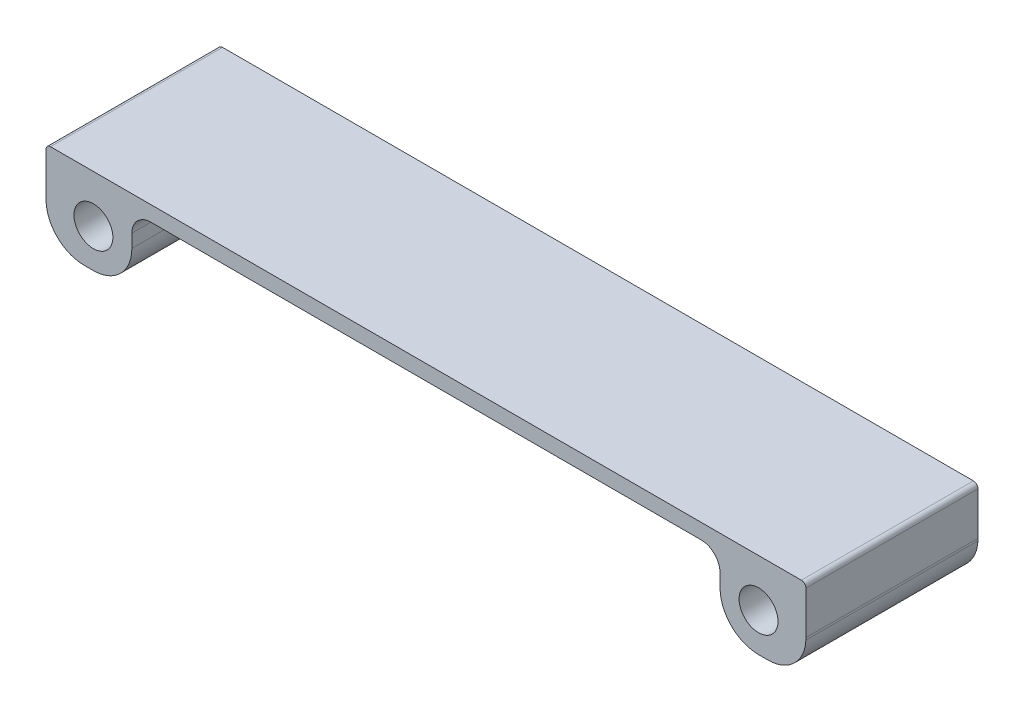
ISO-10303-21;
HEADER;
FILE_DESCRIPTION(('STEP AP214'),'2;1');
FILE_NAME('part.step','',(''),(''),'','','');
FILE_SCHEMA(('AUTOMOTIVE_DESIGN { 1 0 10303 214 1 1 1 1 }'));
ENDSEC;
DATA;
#1=APPLICATION_CONTEXT('core data for automotive mechanical design processes');
#2=APPLICATION_PROTOCOL_DEFINITION('international standard','automotive_design',2000,#1);
#3=PRODUCT_CONTEXT('',#1,'mechanical');
#4=PRODUCT('Part','Part','',(#3));
#5=PRODUCT_RELATED_PRODUCT_CATEGORY('part','',(#4));
#6=PRODUCT_DEFINITION_FORMATION('','',#4);
#7=PRODUCT_DEFINITION_CONTEXT('part definition',#1,'design');
#8=PRODUCT_DEFINITION('design','',#6,#7);
#9=PRODUCT_DEFINITION_SHAPE('','',#8);
#10=(LENGTH_UNIT() NAMED_UNIT(*) SI_UNIT(.MILLI.,.METRE.));
#11=(NAMED_UNIT(*) PLANE_ANGLE_UNIT() SI_UNIT($,.RADIAN.));
#12=(NAMED_UNIT(*) SI_UNIT($,.STERADIAN.) SOLID_ANGLE_UNIT());
#13=UNCERTAINTY_MEASURE_WITH_UNIT(LENGTH_MEASURE(1.E-05),#10,'distance_accuracy_value','');
#14=(GEOMETRIC_REPRESENTATION_CONTEXT(3) GLOBAL_UNCERTAINTY_ASSIGNED_CONTEXT((#13)) GLOBAL_UNIT_ASSIGNED_CONTEXT((#10,
#11,#12)) REPRESENTATION_CONTEXT('',''));
#15=CARTESIAN_POINT('',(0.,0.,0.));
#16=DIRECTION('',(0.,0.,1.));
#17=DIRECTION('',(1.,0.,0.));
#18=AXIS2_PLACEMENT_3D('',#15,#16,#17);
#19=CARTESIAN_POINT('',(0.,-6.42619999985807,0.));
#20=DIRECTION('',(0.,1.,0.));
#21=DIRECTION('',(0.,0.,1.));
#22=AXIS2_PLACEMENT_3D('',#19,#20,#21);
#23=PLANE('',#22);
#24=DIRECTION('',(0.,0.,-1.));
#25=VECTOR('',#24,1.);
#26=CARTESIAN_POINT('',(-1.572955371228,-6.4262,14.3763999995843));
#27=LINE('',#26,#25);
#28=CARTESIAN_POINT('',(-1.572955371228,-6.42619999992903,28.7528));
#29=VERTEX_POINT('',#28);
#30=CARTESIAN_POINT('',(-1.572955371228,-6.42619999996452,-4.15745562976078E-10));
#31=VERTEX_POINT('',#30);
#32=EDGE_CURVE('E157',#29,#31,#27,.T.);
#33=ORIENTED_EDGE('',*,*,#32,.T.);
#34=DIRECTION('',(1.,0.,0.));
#35=VECTOR('',#34,1.);
#36=CARTESIAN_POINT('',(0.,-6.42619999985807,0.));
#37=LINE('',#36,#35);
#38=CARTESIAN_POINT('',(-4.41073369258682E-10,-6.42619999992903,0.));
#39=VERTEX_POINT('',#38);
#40=EDGE_CURVE('E278',#39,#31,#37,.F.);
#41=ORIENTED_EDGE('',*,*,#40,.F.);
#42=DIRECTION('',(0.,0.,1.));
#43=VECTOR('',#42,1.);
#44=CARTESIAN_POINT('',(-8.82146738517363E-10,-6.4262,14.3763999995843));
#45=LINE('',#44,#43);
#46=CARTESIAN_POINT('',(-4.41073369258682E-10,-6.42619999992903,28.7528));
#47=VERTEX_POINT('',#46);
#48=EDGE_CURVE('E259',#39,#47,#45,.T.);
#49=ORIENTED_EDGE('',*,*,#48,.T.);
#50=DIRECTION('',(1.,0.,0.));
#51=VECTOR('',#50,1.);
#52=CARTESIAN_POINT('',(0.,-6.42619999985807,28.7528));
#53=LINE('',#52,#51);
#54=EDGE_CURVE('E149',#29,#47,#53,.T.);
#55=ORIENTED_EDGE('',*,*,#54,.F.);
#56=EDGE_LOOP('',(#33,#41,#49,#55));
#57=FACE_BOUND('',#56,.T.);
#58=ADVANCED_FACE('F17',(#57),#23,.F.);
#59=CARTESIAN_POINT('',(0.,0.,28.7528));
#60=DIRECTION('',(0.,0.,-1.));
#61=DIRECTION('',(0.,1.,0.));
#62=AXIS2_PLACEMENT_3D('',#59,#60,#61);
#63=CYLINDRICAL_SURFACE('',#62,7.92479999937038);
#64=DIRECTION('',(0.,0.,1.));
#65=VECTOR('',#64,1.);
#66=CARTESIAN_POINT('',(-7.91551735214925,-0.383458064454545,14.3763999995843));
#67=LINE('',#66,#65);
#68=CARTESIAN_POINT('',(-7.91551735185295,-0.383458064474924,-8.31491993313893E-10));
#69=VERTEX_POINT('',#68);
#70=CARTESIAN_POINT('',(-7.91551735185295,-0.383458064474936,28.7528));
#71=VERTEX_POINT('',#70);
#72=EDGE_CURVE('E151',#69,#71,#67,.T.);
#73=ORIENTED_EDGE('',*,*,#72,.T.);
#74=CARTESIAN_POINT('',(0.,0.,28.7528));
#75=DIRECTION('',(0.,0.,-1.));
#76=DIRECTION('',(0.,1.,0.));
#77=AXIS2_PLACEMENT_3D('',#74,#75,#76);
#78=CIRCLE('',#77,7.92479999937038);
#79=CARTESIAN_POINT('',(-7.92480000050323,0.,28.7527999988129));
#80=VERTEX_POINT('',#79);
#81=EDGE_CURVE('E20',#80,#71,#78,.F.);
#82=ORIENTED_EDGE('',*,*,#81,.F.);
#83=DIRECTION('',(0.,0.,-1.));
#84=VECTOR('',#83,1.);
#85=CARTESIAN_POINT('',(-7.9248000020129,0.,0.));
#86=LINE('',#85,#84);
#87=CARTESIAN_POINT('',(-7.92480000100645,0.,-8.31491209890388E-10));
#88=VERTEX_POINT('',#87);
#89=EDGE_CURVE('E223',#80,#88,#86,.T.);
#90=ORIENTED_EDGE('',*,*,#89,.T.);
#91=CARTESIAN_POINT('',(0.,0.,-8.31491125952155E-10));
#92=DIRECTION('',(0.,0.,-1.));
#93=DIRECTION('',(0.,1.,0.));
#94=AXIS2_PLACEMENT_3D('',#91,#92,#93);
#95=CIRCLE('',#94,7.92479999937038);
#96=EDGE_CURVE('E148',#69,#88,#95,.T.);
#97=ORIENTED_EDGE('',*,*,#96,.F.);
#98=EDGE_LOOP('',(#73,#82,#90,#97));
#99=FACE_BOUND('',#98,.T.);
#100=ADVANCED_FACE('F152',(#99),#63,.T.);
#101=CARTESIAN_POINT('',(-7.1628,7.1628,28.7528));
#102=DIRECTION('',(0.,0.,-1.));
#103=DIRECTION('',(0.,1.,0.));
#104=AXIS2_PLACEMENT_3D('',#101,#102,#103);
#105=CYLINDRICAL_SURFACE('',#104,0.762000000000001);
#106=DIRECTION('',(0.,0.,-1.));
#107=VECTOR('',#106,1.);
#108=CARTESIAN_POINT('',(-7.9248000020129,7.1628,0.));
#109=LINE('',#108,#107);
#110=CARTESIAN_POINT('',(-7.92480000100645,7.16279999999997,-8.31491125952155E-10));
#111=VERTEX_POINT('',#110);
#112=CARTESIAN_POINT('',(-7.92480000050323,7.1628,28.7527999988129));
#113=VERTEX_POINT('',#112);
#114=EDGE_CURVE('E156',#111,#113,#109,.F.);
#115=ORIENTED_EDGE('',*,*,#114,.T.);
#116=CARTESIAN_POINT('',(-7.1628,7.1628,28.7528));
#117=DIRECTION('',(0.,0.,-1.));
#118=DIRECTION('',(0.,1.,0.));
#119=AXIS2_PLACEMENT_3D('',#116,#117,#118);
#120=CIRCLE('',#119,0.762000000000001);
#121=CARTESIAN_POINT('',(-7.1628,7.92480000050323,28.7527999988129));
#122=VERTEX_POINT('',#121);
#123=EDGE_CURVE('E217',#122,#113,#120,.F.);
#124=ORIENTED_EDGE('',*,*,#123,.F.);
#125=DIRECTION('',(0.,0.,-1.));
#126=VECTOR('',#125,1.);
#127=CARTESIAN_POINT('',(-7.1628,7.9248000020129,0.));
#128=LINE('',#127,#126);
#129=CARTESIAN_POINT('',(-7.1628,7.92480000100645,-8.31492860675633E-10));
#130=VERTEX_POINT('',#129);
#131=EDGE_CURVE('E249',#122,#130,#128,.T.);
#132=ORIENTED_EDGE('',*,*,#131,.T.);
#133=CARTESIAN_POINT('',(-7.1628,7.16279999999994,-8.31491125952155E-10));
#134=DIRECTION('',(0.,0.,-1.));
#135=DIRECTION('',(0.,1.,0.));
#136=AXIS2_PLACEMENT_3D('',#133,#134,#135);
#137=CIRCLE('',#136,0.762000000000001);
#138=EDGE_CURVE('E215',#111,#130,#137,.T.);
#139=ORIENTED_EDGE('',*,*,#138,.F.);
#140=EDGE_LOOP('',(#115,#124,#132,#139));
#141=FACE_BOUND('',#140,.T.);
#142=ADVANCED_FACE('F340',(#141),#105,.T.);
#143=CARTESIAN_POINT('',(118.3132,7.1628,28.7528));
#144=DIRECTION('',(0.,0.,-1.));
#145=DIRECTION('',(-1.,0.,0.));
#146=AXIS2_PLACEMENT_3D('',#143,#144,#145);
#147=CYLINDRICAL_SURFACE('',#146,0.762000000000001);
#148=DIRECTION('',(0.,0.,-1.));
#149=VECTOR('',#148,1.);
#150=CARTESIAN_POINT('',(118.3132,7.9248000020129,0.));
#151=LINE('',#150,#149);
#152=CARTESIAN_POINT('',(118.3132,7.92480000100645,-8.31491125952155E-10));
#153=VERTEX_POINT('',#152);
#154=CARTESIAN_POINT('',(118.3132,7.92480000050323,28.7527999988129));
#155=VERTEX_POINT('',#154);
#156=EDGE_CURVE('E225',#153,#155,#151,.F.);
#157=ORIENTED_EDGE('',*,*,#156,.T.);
#158=CARTESIAN_POINT('',(118.3132,7.1628,28.7528));
#159=DIRECTION('',(0.,0.,-1.));
#160=DIRECTION('',(-1.,0.,0.));
#161=AXIS2_PLACEMENT_3D('',#158,#159,#160);
#162=CIRCLE('',#161,0.762000000000001);
#163=CARTESIAN_POINT('',(119.075199989316,7.1628,28.7528));
#164=VERTEX_POINT('',#163);
#165=EDGE_CURVE('E213',#164,#155,#162,.F.);
#166=ORIENTED_EDGE('',*,*,#165,.F.);
#167=DIRECTION('',(0.,0.,1.));
#168=VECTOR('',#167,1.);
#169=CARTESIAN_POINT('',(119.075199978632,7.1628,0.));
#170=LINE('',#169,#168);
#171=CARTESIAN_POINT('',(119.075199989316,7.1628,-8.31492860675607E-10));
#172=VERTEX_POINT('',#171);
#173=EDGE_CURVE('E246',#164,#172,#170,.F.);
#174=ORIENTED_EDGE('',*,*,#173,.T.);
#175=CARTESIAN_POINT('',(118.3132,7.1628,-8.31491125952155E-10));
#176=DIRECTION('',(0.,0.,-1.));
#177=DIRECTION('',(-1.,0.,0.));
#178=AXIS2_PLACEMENT_3D('',#175,#176,#177);
#179=CIRCLE('',#178,0.762000000000001);
#180=EDGE_CURVE('E211',#153,#172,#179,.T.);
#181=ORIENTED_EDGE('',*,*,#180,.F.);
#182=EDGE_LOOP('',(#157,#166,#174,#181));
#183=FACE_BOUND('',#182,.T.);
#184=ADVANCED_FACE('F399',(#183),#147,.T.);
#185=CARTESIAN_POINT('',(0.,-6.42619999985807,0.));
#186=DIRECTION('',(0.,1.,0.));
#187=DIRECTION('',(0.,0.,1.));
#188=AXIS2_PLACEMENT_3D('',#185,#186,#187);
#189=PLANE('',#188);
#190=DIRECTION('',(0.,0.,1.));
#191=VECTOR('',#190,1.);
#192=CARTESIAN_POINT('',(112.7233553758,-6.42619998469529,14.3763999995843));
#193=LINE('',#192,#191);
#194=CARTESIAN_POINT('',(112.7233553758,-6.42619999227668,-8.31492859659656E-10));
#195=VERTEX_POINT('',#194);
#196=CARTESIAN_POINT('',(112.7233553758,-6.42619999227668,28.7528));
#197=VERTEX_POINT('',#196);
#198=EDGE_CURVE('E241',#195,#197,#193,.T.);
#199=ORIENTED_EDGE('',*,*,#198,.T.);
#200=DIRECTION('',(1.,0.,0.));
#201=VECTOR('',#200,1.);
#202=CARTESIAN_POINT('',(0.,-6.42619999985807,28.7528));
#203=LINE('',#202,#201);
#204=CARTESIAN_POINT('',(111.1504,-6.42619999992903,28.7528));
#205=VERTEX_POINT('',#204);
#206=EDGE_CURVE('E35',#205,#197,#203,.T.);
#207=ORIENTED_EDGE('',*,*,#206,.F.);
#208=DIRECTION('',(0.,0.,-1.));
#209=VECTOR('',#208,1.);
#210=CARTESIAN_POINT('',(111.1504,-6.4262,14.3763999995843));
#211=LINE('',#210,#209);
#212=CARTESIAN_POINT('',(111.1504,-6.42619999996452,-4.15745562976078E-10));
#213=VERTEX_POINT('',#212);
#214=EDGE_CURVE('E207',#205,#213,#211,.T.);
#215=ORIENTED_EDGE('',*,*,#214,.T.);
#216=DIRECTION('',(1.,0.,0.));
#217=VECTOR('',#216,1.);
#218=CARTESIAN_POINT('',(0.,-6.42619999985807,0.));
#219=LINE('',#218,#217);
#220=EDGE_CURVE('E210',#195,#213,#219,.F.);
#221=ORIENTED_EDGE('',*,*,#220,.F.);
#222=EDGE_LOOP('',(#199,#207,#215,#221));
#223=FACE_BOUND('',#222,.T.);
#224=ADVANCED_FACE('F395',(#223),#189,.F.);
#225=CARTESIAN_POINT('',(111.1504,0.,28.7528));
#226=DIRECTION('',(0.,0.,-1.));
#227=DIRECTION('',(0.,1.,0.));
#228=AXIS2_PLACEMENT_3D('',#225,#226,#227);
#229=CYLINDRICAL_SURFACE('',#228,7.92479999999998);
#230=DIRECTION('',(0.,0.,-1.));
#231=VECTOR('',#230,1.);
#232=CARTESIAN_POINT('',(119.0659173414,-0.383458064426,14.3763999995843));
#233=LINE('',#232,#231);
#234=CARTESIAN_POINT('',(119.06591734682,-0.383458063919918,28.7528));
#235=VERTEX_POINT('',#234);
#236=CARTESIAN_POINT('',(119.06591734682,-0.383458063919911,-2.0921442161883E-09));
#237=VERTEX_POINT('',#236);
#238=EDGE_CURVE('E240',#235,#237,#233,.T.);
#239=ORIENTED_EDGE('',*,*,#238,.T.);
#240=CARTESIAN_POINT('',(111.1504,0.,0.));
#241=DIRECTION('',(0.,0.,-1.));
#242=DIRECTION('',(0.,1.,0.));
#243=AXIS2_PLACEMENT_3D('',#240,#241,#242);
#244=CIRCLE('',#243,7.92479999999998);
#245=CARTESIAN_POINT('',(119.075199989316,4.41074326544306E-10,0.));
#246=VERTEX_POINT('',#245);
#247=EDGE_CURVE('E208',#246,#237,#244,.T.);
#248=ORIENTED_EDGE('',*,*,#247,.F.);
#249=DIRECTION('',(0.,0.,1.));
#250=VECTOR('',#249,1.);
#251=CARTESIAN_POINT('',(119.075199978632,8.82142359156E-10,0.));
#252=LINE('',#251,#250);
#253=CARTESIAN_POINT('',(119.075199989316,4.41071179578E-10,28.7528));
#254=VERTEX_POINT('',#253);
#255=EDGE_CURVE('E243',#246,#254,#252,.T.);
#256=ORIENTED_EDGE('',*,*,#255,.T.);
#257=CARTESIAN_POINT('',(111.1504,0.,28.7528));
#258=DIRECTION('',(0.,0.,-1.));
#259=DIRECTION('',(0.,1.,0.));
#260=AXIS2_PLACEMENT_3D('',#257,#258,#259);
#261=CIRCLE('',#260,7.92479999999998);
#262=EDGE_CURVE('E205',#235,#254,#261,.F.);
#263=ORIENTED_EDGE('',*,*,#262,.F.);
#264=EDGE_LOOP('',(#239,#248,#256,#263));
#265=FACE_BOUND('',#264,.T.);
#266=ADVANCED_FACE('F391',(#265),#229,.T.);
#267=CARTESIAN_POINT('',(111.1504,0.,28.7528));
#268=DIRECTION('',(0.,0.,-1.));
#269=DIRECTION('',(-1.,0.,0.));
#270=AXIS2_PLACEMENT_3D('',#267,#268,#269);
#271=CYLINDRICAL_SURFACE('',#270,6.4262);
#272=ORIENTED_EDGE('',*,*,#214,.F.);
#273=CARTESIAN_POINT('',(111.1504,0.,28.7528));
#274=DIRECTION('',(0.,0.,-1.));
#275=DIRECTION('',(-1.,0.,0.));
#276=AXIS2_PLACEMENT_3D('',#273,#274,#275);
#277=CIRCLE('',#276,6.4262);
#278=CARTESIAN_POINT('',(104.724199985477,0.,28.7528));
#279=VERTEX_POINT('',#278);
#280=EDGE_CURVE('E179',#205,#279,#277,.T.);
#281=ORIENTED_EDGE('',*,*,#280,.T.);
#282=DIRECTION('',(0.,0.,-1.));
#283=VECTOR('',#282,1.);
#284=CARTESIAN_POINT('',(104.724199970955,0.,0.));
#285=LINE('',#284,#283);
#286=CARTESIAN_POINT('',(104.724199985477,0.,-8.31492860675635E-10));
#287=VERTEX_POINT('',#286);
#288=EDGE_CURVE('E271',#279,#287,#285,.T.);
#289=ORIENTED_EDGE('',*,*,#288,.T.);
#290=CARTESIAN_POINT('',(111.1504,0.,-8.31491125952155E-10));
#291=DIRECTION('',(0.,0.,-1.));
#292=DIRECTION('',(-1.,0.,0.));
#293=AXIS2_PLACEMENT_3D('',#290,#291,#292);
#294=CIRCLE('',#293,6.4262);
#295=EDGE_CURVE('E187',#287,#213,#294,.F.);
#296=ORIENTED_EDGE('',*,*,#295,.T.);
#297=EDGE_LOOP('',(#272,#281,#289,#296));
#298=FACE_BOUND('',#297,.T.);
#299=ADVANCED_FACE('F387',(#298),#271,.T.);
#300=CARTESIAN_POINT('',(104.724199970955,0.,0.));
#301=DIRECTION('',(1.,0.,0.));
#302=DIRECTION('',(0.,0.,-1.));
#303=AXIS2_PLACEMENT_3D('',#300,#301,#302);
#304=PLANE('',#303);
#305=ORIENTED_EDGE('',*,*,#288,.F.);
#306=DIRECTION('',(0.,1.,0.));
#307=VECTOR('',#306,1.);
#308=CARTESIAN_POINT('',(104.7242,0.,28.7527999976258));
#309=LINE('',#308,#307);
#310=CARTESIAN_POINT('',(104.7242,2.209799999873,28.7527999988129));
#311=VERTEX_POINT('',#310);
#312=EDGE_CURVE('E178',#279,#311,#309,.T.);
#313=ORIENTED_EDGE('',*,*,#312,.T.);
#314=DIRECTION('',(0.,0.,1.));
#315=VECTOR('',#314,1.);
#316=CARTESIAN_POINT('',(104.7242,2.20979999974601,14.3763999995843));
#317=LINE('',#316,#315);
#318=CARTESIAN_POINT('',(104.7242,2.209799999873,-4.1574469561434E-10));
#319=VERTEX_POINT('',#318);
#320=EDGE_CURVE('E269',#311,#319,#317,.F.);
#321=ORIENTED_EDGE('',*,*,#320,.T.);
#322=DIRECTION('',(0.,1.,0.));
#323=VECTOR('',#322,1.);
#324=CARTESIAN_POINT('',(104.7242,0.,0.));
#325=LINE('',#324,#323);
#326=EDGE_CURVE('E190',#319,#287,#325,.F.);
#327=ORIENTED_EDGE('',*,*,#326,.T.);
#328=EDGE_LOOP('',(#305,#313,#321,#327));
#329=FACE_BOUND('',#328,.T.);
#330=ADVANCED_FACE('F384',(#329),#304,.F.);
#331=CARTESIAN_POINT('',(101.5492,2.2098,28.7528));
#332=DIRECTION('',(0.,0.,-1.));
#333=DIRECTION('',(-1.,0.,0.));
#334=AXIS2_PLACEMENT_3D('',#331,#332,#333);
#335=CYLINDRICAL_SURFACE('',#334,3.175);
#336=ORIENTED_EDGE('',*,*,#320,.F.);
#337=CARTESIAN_POINT('',(101.5492,2.2098,28.7528));
#338=DIRECTION('',(0.,0.,-1.));
#339=DIRECTION('',(-1.,0.,0.));
#340=AXIS2_PLACEMENT_3D('',#337,#338,#339);
#341=CIRCLE('',#340,3.175);
#342=CARTESIAN_POINT('',(101.5492,5.38480000005806,28.7527999988129));
#343=VERTEX_POINT('',#342);
#344=EDGE_CURVE('E176',#311,#343,#341,.F.);
#345=ORIENTED_EDGE('',*,*,#344,.T.);
#346=DIRECTION('',(0.,0.,1.));
#347=VECTOR('',#346,1.);
#348=CARTESIAN_POINT('',(101.5492,5.38480000007742,0.));
#349=LINE('',#348,#347);
#350=CARTESIAN_POINT('',(101.5492,5.38480000001936,-4.15743828252602E-10));
#351=VERTEX_POINT('',#350);
#352=EDGE_CURVE('E267',#343,#351,#349,.F.);
#353=ORIENTED_EDGE('',*,*,#352,.T.);
#354=CARTESIAN_POINT('',(101.5492,2.2098,-8.31487656505203E-10));
#355=DIRECTION('',(0.,0.,-1.));
#356=DIRECTION('',(-1.,0.,0.));
#357=AXIS2_PLACEMENT_3D('',#354,#355,#356);
#358=CIRCLE('',#357,3.175);
#359=EDGE_CURVE('E191',#351,#319,#358,.T.);
#360=ORIENTED_EDGE('',*,*,#359,.T.);
#361=EDGE_LOOP('',(#336,#345,#353,#360));
#362=FACE_BOUND('',#361,.T.);
#363=ADVANCED_FACE('F316',(#362),#335,.F.);
#364=CARTESIAN_POINT('',(0.,5.38480000007742,0.));
#365=DIRECTION('',(0.,1.,0.));
#366=DIRECTION('',(0.,0.,1.));
#367=AXIS2_PLACEMENT_3D('',#364,#365,#366);
#368=PLANE('',#367);
#369=ORIENTED_EDGE('',*,*,#352,.F.);
#370=DIRECTION('',(-1.,0.,0.));
#371=VECTOR('',#370,1.);
#372=CARTESIAN_POINT('',(0.,5.3848,28.7527999976258));
#373=LINE('',#372,#371);
#374=CARTESIAN_POINT('',(9.6012,5.3848,28.7527999988129));
#375=VERTEX_POINT('',#374);
#376=EDGE_CURVE('E175',#343,#375,#373,.T.);
#377=ORIENTED_EDGE('',*,*,#376,.T.);
#378=DIRECTION('',(0.,0.,1.));
#379=VECTOR('',#378,1.);
#380=CARTESIAN_POINT('',(9.6012,5.3848,14.3763999995843));
#381=LINE('',#380,#379);
#382=CARTESIAN_POINT('',(9.6012,5.3848,-4.15746430337816E-10));
#383=VERTEX_POINT('',#382);
#384=EDGE_CURVE('E265',#375,#383,#381,.F.);
#385=ORIENTED_EDGE('',*,*,#384,.T.);
#386=DIRECTION('',(-1.,0.,0.));
#387=VECTOR('',#386,1.);
#388=CARTESIAN_POINT('',(0.,5.3848,0.));
#389=LINE('',#388,#387);
#390=EDGE_CURVE('E194',#383,#351,#389,.F.);
#391=ORIENTED_EDGE('',*,*,#390,.T.);
#392=EDGE_LOOP('',(#369,#377,#385,#391));
#393=FACE_BOUND('',#392,.T.);
#394=ADVANCED_FACE('F308',(#393),#368,.F.);
#395=CARTESIAN_POINT('',(9.6012,2.2098,28.7528));
#396=DIRECTION('',(0.,0.,-1.));
#397=DIRECTION('',(0.,1.,0.));
#398=AXIS2_PLACEMENT_3D('',#395,#396,#397);
#399=CYLINDRICAL_SURFACE('',#398,3.175);
#400=ORIENTED_EDGE('',*,*,#384,.F.);
#401=CARTESIAN_POINT('',(9.6012,2.2098,28.7528));
#402=DIRECTION('',(0.,0.,-1.));
#403=DIRECTION('',(0.,1.,0.));
#404=AXIS2_PLACEMENT_3D('',#401,#402,#403);
#405=CIRCLE('',#404,3.175);
#406=CARTESIAN_POINT('',(6.42619999996452,2.209799999873,28.7527999988129));
#407=VERTEX_POINT('',#406);
#408=EDGE_CURVE('E173',#375,#407,#405,.F.);
#409=ORIENTED_EDGE('',*,*,#408,.T.);
#410=DIRECTION('',(0.,0.,1.));
#411=VECTOR('',#410,1.);
#412=CARTESIAN_POINT('',(6.42619999985807,2.209799999746,0.));
#413=LINE('',#412,#411);
#414=CARTESIAN_POINT('',(6.42619999996452,2.20979999987299,-4.15745562976078E-10));
#415=VERTEX_POINT('',#414);
#416=EDGE_CURVE('E262',#407,#415,#413,.F.);
#417=ORIENTED_EDGE('',*,*,#416,.T.);
#418=CARTESIAN_POINT('',(9.6012,2.20979999999999,-8.31491125952155E-10));
#419=DIRECTION('',(0.,0.,-1.));
#420=DIRECTION('',(0.,1.,0.));
#421=AXIS2_PLACEMENT_3D('',#418,#419,#420);
#422=CIRCLE('',#421,3.175);
#423=EDGE_CURVE('E195',#415,#383,#422,.T.);
#424=ORIENTED_EDGE('',*,*,#423,.T.);
#425=EDGE_LOOP('',(#400,#409,#417,#424));
#426=FACE_BOUND('',#425,.T.);
#427=ADVANCED_FACE('F322',(#426),#399,.F.);
#428=CARTESIAN_POINT('',(6.42619999985807,0.,0.));
#429=DIRECTION('',(-1.,0.,0.));
#430=DIRECTION('',(0.,0.,1.));
#431=AXIS2_PLACEMENT_3D('',#428,#429,#430);
#432=PLANE('',#431);
#433=ORIENTED_EDGE('',*,*,#416,.F.);
#434=DIRECTION('',(0.,1.,0.));
#435=VECTOR('',#434,1.);
#436=CARTESIAN_POINT('',(6.4262,0.,28.7527999976258));
#437=LINE('',#436,#435);
#438=CARTESIAN_POINT('',(6.4262,0.,28.7527999988129));
#439=VERTEX_POINT('',#438);
#440=EDGE_CURVE('E167',#407,#439,#437,.F.);
#441=ORIENTED_EDGE('',*,*,#440,.T.);
#442=DIRECTION('',(0.,0.,-1.));
#443=VECTOR('',#442,1.);
#444=CARTESIAN_POINT('',(6.4262,0.,14.3763999995843));
#445=LINE('',#444,#443);
#446=CARTESIAN_POINT('',(6.4262,0.,0.));
#447=VERTEX_POINT('',#446);
#448=EDGE_CURVE('E258',#439,#447,#445,.T.);
#449=ORIENTED_EDGE('',*,*,#448,.T.);
#450=DIRECTION('',(0.,1.,0.));
#451=VECTOR('',#450,1.);
#452=CARTESIAN_POINT('',(6.4262,0.,0.));
#453=LINE('',#452,#451);
#454=EDGE_CURVE('E198',#447,#415,#453,.T.);
#455=ORIENTED_EDGE('',*,*,#454,.T.);
#456=EDGE_LOOP('',(#433,#441,#449,#455));
#457=FACE_BOUND('',#456,.T.);
#458=ADVANCED_FACE('F328',(#457),#432,.F.);
#459=CARTESIAN_POINT('',(0.,0.,28.7528));
#460=DIRECTION('',(0.,0.,-1.));
#461=DIRECTION('',(0.,1.,0.));
#462=AXIS2_PLACEMENT_3D('',#459,#460,#461);
#463=CYLINDRICAL_SURFACE('',#462,6.4262);
#464=ORIENTED_EDGE('',*,*,#448,.F.);
#465=CARTESIAN_POINT('',(0.,0.,28.7528));
#466=DIRECTION('',(0.,0.,-1.));
#467=DIRECTION('',(0.,1.,0.));
#468=AXIS2_PLACEMENT_3D('',#465,#466,#467);
#469=CIRCLE('',#468,6.4262);
#470=EDGE_CURVE('E162',#439,#47,#469,.T.);
#471=ORIENTED_EDGE('',*,*,#470,.T.);
#472=ORIENTED_EDGE('',*,*,#48,.F.);
#473=CARTESIAN_POINT('',(0.,0.,0.));
#474=DIRECTION('',(0.,0.,-1.));
#475=DIRECTION('',(0.,1.,0.));
#476=AXIS2_PLACEMENT_3D('',#473,#474,#475);
#477=CIRCLE('',#476,6.4262);
#478=EDGE_CURVE('E199',#39,#447,#477,.F.);
#479=ORIENTED_EDGE('',*,*,#478,.T.);
#480=EDGE_LOOP('',(#464,#471,#472,#479));
#481=FACE_BOUND('',#480,.T.);
#482=ADVANCED_FACE('F333',(#481),#463,.T.);
#483=CARTESIAN_POINT('',(-1.572955371228,-0.0762000000000002,28.7528));
#484=DIRECTION('',(0.,0.,-1.));
#485=DIRECTION('',(-1.,0.,0.));
#486=AXIS2_PLACEMENT_3D('',#483,#484,#485);
#487=CYLINDRICAL_SURFACE('',#486,6.35);
#488=ORIENTED_EDGE('',*,*,#72,.F.);
#489=CARTESIAN_POINT('',(-1.57295537122799,-0.0762000000000002,-8.31491125952155E-10));
#490=DIRECTION('',(0.,0.,-1.));
#491=DIRECTION('',(-1.,0.,0.));
#492=AXIS2_PLACEMENT_3D('',#489,#490,#491);
#493=CIRCLE('',#492,6.35);
#494=EDGE_CURVE('E202',#69,#31,#493,.F.);
#495=ORIENTED_EDGE('',*,*,#494,.T.);
#496=ORIENTED_EDGE('',*,*,#32,.F.);
#497=CARTESIAN_POINT('',(-1.572955371228,-0.0762000000000002,28.7528));
#498=DIRECTION('',(0.,0.,-1.));
#499=DIRECTION('',(-1.,0.,0.));
#500=AXIS2_PLACEMENT_3D('',#497,#498,#499);
#501=CIRCLE('',#500,6.35);
#502=EDGE_CURVE('E145',#29,#71,#501,.T.);
#503=ORIENTED_EDGE('',*,*,#502,.T.);
#504=EDGE_LOOP('',(#488,#495,#496,#503));
#505=FACE_BOUND('',#504,.T.);
#506=ADVANCED_FACE('F160',(#505),#487,.T.);
#507=CARTESIAN_POINT('',(-7.9248000020129,0.,0.));
#508=DIRECTION('',(1.,0.,0.));
#509=DIRECTION('',(0.,0.,-1.));
#510=AXIS2_PLACEMENT_3D('',#507,#508,#509);
#511=PLANE('',#510);
#512=ORIENTED_EDGE('',*,*,#89,.F.);
#513=DIRECTION('',(0.,1.,0.));
#514=VECTOR('',#513,1.);
#515=CARTESIAN_POINT('',(-7.9248,0.,28.7527999976258));
#516=LINE('',#515,#514);
#517=EDGE_CURVE('E147',#80,#113,#516,.T.);
#518=ORIENTED_EDGE('',*,*,#517,.T.);
#519=ORIENTED_EDGE('',*,*,#114,.F.);
#520=DIRECTION('',(0.,1.,0.));
#521=VECTOR('',#520,1.);
#522=CARTESIAN_POINT('',(-7.9248,0.,0.));
#523=LINE('',#522,#521);
#524=EDGE_CURVE('E204',#111,#88,#523,.F.);
#525=ORIENTED_EDGE('',*,*,#524,.T.);
#526=EDGE_LOOP('',(#512,#518,#519,#525));
#527=FACE_BOUND('',#526,.T.);
#528=ADVANCED_FACE('F228',(#527),#511,.F.);
#529=CARTESIAN_POINT('',(0.,7.9248000020129,0.));
#530=DIRECTION('',(0.,-1.,0.));
#531=DIRECTION('',(0.,0.,-1.));
#532=AXIS2_PLACEMENT_3D('',#529,#530,#531);
#533=PLANE('',#532);
#534=ORIENTED_EDGE('',*,*,#131,.F.);
#535=DIRECTION('',(-1.,0.,0.));
#536=VECTOR('',#535,1.);
#537=CARTESIAN_POINT('',(0.,7.9248,28.7527999976258));
#538=LINE('',#537,#536);
#539=EDGE_CURVE('E164',#122,#155,#538,.F.);
#540=ORIENTED_EDGE('',*,*,#539,.T.);
#541=ORIENTED_EDGE('',*,*,#156,.F.);
#542=DIRECTION('',(-1.,0.,0.));
#543=VECTOR('',#542,1.);
#544=CARTESIAN_POINT('',(0.,7.9248,0.));
#545=LINE('',#544,#543);
#546=EDGE_CURVE('E230',#153,#130,#545,.T.);
#547=ORIENTED_EDGE('',*,*,#546,.T.);
#548=EDGE_LOOP('',(#534,#540,#541,#547));
#549=FACE_BOUND('',#548,.T.);
#550=ADVANCED_FACE('F366',(#549),#533,.F.);
#551=CARTESIAN_POINT('',(119.075199978632,0.,0.));
#552=DIRECTION('',(-1.,0.,0.));
#553=DIRECTION('',(0.,0.,1.));
#554=AXIS2_PLACEMENT_3D('',#551,#552,#553);
#555=PLANE('',#554);
#556=DIRECTION('',(0.,1.,0.));
#557=VECTOR('',#556,1.);
#558=CARTESIAN_POINT('',(119.0752,0.,0.));
#559=LINE('',#558,#557);
#560=EDGE_CURVE('E233',#246,#172,#559,.T.);
#561=ORIENTED_EDGE('',*,*,#560,.T.);
#562=ORIENTED_EDGE('',*,*,#173,.F.);
#563=DIRECTION('',(0.,1.,0.));
#564=VECTOR('',#563,1.);
#565=CARTESIAN_POINT('',(119.0752,0.,28.7527999976258));
#566=LINE('',#565,#564);
#567=EDGE_CURVE('E286',#164,#254,#566,.F.);
#568=ORIENTED_EDGE('',*,*,#567,.T.);
#569=ORIENTED_EDGE('',*,*,#255,.F.);
#570=EDGE_LOOP('',(#561,#562,#568,#569));
#571=FACE_BOUND('',#570,.T.);
#572=ADVANCED_FACE('F363',(#571),#555,.F.);
#573=CARTESIAN_POINT('',(112.7233553758,-0.0762,28.7528));
#574=DIRECTION('',(0.,0.,-1.));
#575=DIRECTION('',(0.,1.,0.));
#576=AXIS2_PLACEMENT_3D('',#573,#574,#575);
#577=CYLINDRICAL_SURFACE('',#576,6.34999998469529);
#578=ORIENTED_EDGE('',*,*,#238,.F.);
#579=CARTESIAN_POINT('',(112.7233553758,-0.0762,28.7528));
#580=DIRECTION('',(0.,0.,-1.));
#581=DIRECTION('',(0.,1.,0.));
#582=AXIS2_PLACEMENT_3D('',#579,#580,#581);
#583=CIRCLE('',#582,6.34999998469529);
#584=EDGE_CURVE('E170',#235,#197,#583,.T.);
#585=ORIENTED_EDGE('',*,*,#584,.T.);
#586=ORIENTED_EDGE('',*,*,#198,.F.);
#587=CARTESIAN_POINT('',(112.7233553758,-0.0761999999999922,-8.31491125952155E-10));
#588=DIRECTION('',(0.,0.,-1.));
#589=DIRECTION('',(0.,1.,0.));
#590=AXIS2_PLACEMENT_3D('',#587,#588,#589);
#591=CIRCLE('',#590,6.34999998469529);
#592=EDGE_CURVE('E184',#195,#237,#591,.F.);
#593=ORIENTED_EDGE('',*,*,#592,.T.);
#594=EDGE_LOOP('',(#578,#585,#586,#593));
#595=FACE_BOUND('',#594,.T.);
#596=ADVANCED_FACE('F359',(#595),#577,.T.);
#597=CARTESIAN_POINT('',(0.,0.,28.7528));
#598=DIRECTION('',(0.,0.,-1.));
#599=DIRECTION('',(0.,1.,0.));
#600=AXIS2_PLACEMENT_3D('',#597,#598,#599);
#601=CYLINDRICAL_SURFACE('',#600,3.2512);
#602=CARTESIAN_POINT('',(0.,0.,-8.31491125952155E-10));
#603=DIRECTION('',(0.,0.,-1.));
#604=DIRECTION('',(0.,1.,0.));
#605=AXIS2_PLACEMENT_3D('',#602,#603,#604);
#606=CIRCLE('',#605,3.2512);
#607=CARTESIAN_POINT('',(0.,3.25120000000002,-8.31489391228679E-10));
#608=VERTEX_POINT('',#607);
#609=EDGE_CURVE('E181',#608,#608,#606,.T.);
#610=ORIENTED_EDGE('',*,*,#609,.T.);
#611=EDGE_LOOP('',(#610));
#612=FACE_BOUND('',#611,.T.);
#613=CARTESIAN_POINT('',(0.,0.,28.7528));
#614=DIRECTION('',(0.,0.,-1.));
#615=DIRECTION('',(0.,1.,0.));
#616=AXIS2_PLACEMENT_3D('',#613,#614,#615);
#617=CIRCLE('',#616,3.2512);
#618=CARTESIAN_POINT('',(0.,3.2512,28.7528));
#619=VERTEX_POINT('',#618);
#620=EDGE_CURVE('E281',#619,#619,#617,.F.);
#621=ORIENTED_EDGE('',*,*,#620,.T.);
#622=EDGE_LOOP('',(#621));
#623=FACE_BOUND('',#622,.T.);
#624=ADVANCED_FACE('F355',(#612,#623),#601,.F.);
#625=CARTESIAN_POINT('',(0.,0.,0.));
#626=DIRECTION('',(0.,0.,-1.));
#627=DIRECTION('',(-1.,0.,0.));
#628=AXIS2_PLACEMENT_3D('',#625,#626,#627);
#629=PLANE('',#628);
#630=CARTESIAN_POINT('',(111.1504,0.,-8.31491125952155E-10));
#631=DIRECTION('',(0.,0.,-1.));
#632=DIRECTION('',(0.,1.,0.));
#633=AXIS2_PLACEMENT_3D('',#630,#631,#632);
#634=CIRCLE('',#633,3.25119999999998);
#635=CARTESIAN_POINT('',(111.1504,3.2512,-8.31489391228679E-10));
#636=VERTEX_POINT('',#635);
#637=EDGE_CURVE('E26',#636,#636,#634,.F.);
#638=ORIENTED_EDGE('',*,*,#637,.T.);
#639=EDGE_LOOP('',(#638));
#640=FACE_BOUND('',#639,.T.);
#641=ORIENTED_EDGE('',*,*,#609,.F.);
#642=EDGE_LOOP('',(#641));
#643=FACE_BOUND('',#642,.T.);
#644=ORIENTED_EDGE('',*,*,#592,.F.);
#645=ORIENTED_EDGE('',*,*,#220,.T.);
#646=ORIENTED_EDGE('',*,*,#295,.F.);
#647=ORIENTED_EDGE('',*,*,#326,.F.);
#648=ORIENTED_EDGE('',*,*,#359,.F.);
#649=ORIENTED_EDGE('',*,*,#390,.F.);
#650=ORIENTED_EDGE('',*,*,#423,.F.);
#651=ORIENTED_EDGE('',*,*,#454,.F.);
#652=ORIENTED_EDGE('',*,*,#478,.F.);
#653=ORIENTED_EDGE('',*,*,#40,.T.);
#654=ORIENTED_EDGE('',*,*,#494,.F.);
#655=ORIENTED_EDGE('',*,*,#96,.T.);
#656=ORIENTED_EDGE('',*,*,#524,.F.);
#657=ORIENTED_EDGE('',*,*,#138,.T.);
#658=ORIENTED_EDGE('',*,*,#546,.F.);
#659=ORIENTED_EDGE('',*,*,#180,.T.);
#660=ORIENTED_EDGE('',*,*,#560,.F.);
#661=ORIENTED_EDGE('',*,*,#247,.T.);
#662=EDGE_LOOP('',(#644,#645,#646,#647,#648,#649,#650,#651,#652,#653,#654,#655,#656,#657,#658,
#659,#660,#661));
#663=FACE_BOUND('',#662,.T.);
#664=ADVANCED_FACE('F221',(#640,#643,#663),#629,.T.);
#665=CARTESIAN_POINT('',(0.,0.,28.7527999976258));
#666=DIRECTION('',(0.,0.,-1.));
#667=DIRECTION('',(-1.,0.,0.));
#668=AXIS2_PLACEMENT_3D('',#665,#666,#667);
#669=PLANE('',#668);
#670=CARTESIAN_POINT('',(111.1504,0.,28.7528));
#671=DIRECTION('',(0.,0.,-1.));
#672=DIRECTION('',(0.,1.,0.));
#673=AXIS2_PLACEMENT_3D('',#670,#671,#672);
#674=CIRCLE('',#673,3.25119999999998);
#675=CARTESIAN_POINT('',(111.1504,3.25119999999998,28.7528));
#676=VERTEX_POINT('',#675);
#677=EDGE_CURVE('E11',#676,#676,#674,.T.);
#678=ORIENTED_EDGE('',*,*,#677,.T.);
#679=EDGE_LOOP('',(#678));
#680=FACE_BOUND('',#679,.T.);
#681=ORIENTED_EDGE('',*,*,#620,.F.);
#682=EDGE_LOOP('',(#681));
#683=FACE_BOUND('',#682,.T.);
#684=ORIENTED_EDGE('',*,*,#584,.F.);
#685=ORIENTED_EDGE('',*,*,#262,.T.);
#686=ORIENTED_EDGE('',*,*,#567,.F.);
#687=ORIENTED_EDGE('',*,*,#165,.T.);
#688=ORIENTED_EDGE('',*,*,#539,.F.);
#689=ORIENTED_EDGE('',*,*,#123,.T.);
#690=ORIENTED_EDGE('',*,*,#517,.F.);
#691=ORIENTED_EDGE('',*,*,#81,.T.);
#692=ORIENTED_EDGE('',*,*,#502,.F.);
#693=ORIENTED_EDGE('',*,*,#54,.T.);
#694=ORIENTED_EDGE('',*,*,#470,.F.);
#695=ORIENTED_EDGE('',*,*,#440,.F.);
#696=ORIENTED_EDGE('',*,*,#408,.F.);
#697=ORIENTED_EDGE('',*,*,#376,.F.);
#698=ORIENTED_EDGE('',*,*,#344,.F.);
#699=ORIENTED_EDGE('',*,*,#312,.F.);
#700=ORIENTED_EDGE('',*,*,#280,.F.);
#701=ORIENTED_EDGE('',*,*,#206,.T.);
#702=EDGE_LOOP('',(#684,#685,#686,#687,#688,#689,#690,#691,#692,#693,#694,#695,#696,#697,#698,
#699,#700,#701));
#703=FACE_BOUND('',#702,.T.);
#704=ADVANCED_FACE('F143',(#680,#683,#703),#669,.F.);
#705=CARTESIAN_POINT('',(111.1504,0.,28.7528));
#706=DIRECTION('',(0.,0.,-1.));
#707=DIRECTION('',(0.,1.,0.));
#708=AXIS2_PLACEMENT_3D('',#705,#706,#707);
#709=CYLINDRICAL_SURFACE('',#708,3.25119999999998);
#710=ORIENTED_EDGE('',*,*,#637,.F.);
#711=EDGE_LOOP('',(#710));
#712=FACE_BOUND('',#711,.T.);
#713=ORIENTED_EDGE('',*,*,#677,.F.);
#714=EDGE_LOOP('',(#713));
#715=FACE_BOUND('',#714,.T.);
#716=ADVANCED_FACE('F341',(#712,#715),#709,.F.);
#717=CLOSED_SHELL('',(#58,#100,#142,#184,#224,#266,#299,#330,#363,#394,#427,#458,#482,#506,#528,
#550,#572,#596,#624,#664,#704,#716));
#718=MANIFOLD_SOLID_BREP('B1',#717);
#719=ADVANCED_BREP_SHAPE_REPRESENTATION('',(#18,#718),#14);
#720=SHAPE_DEFINITION_REPRESENTATION(#9,#719);
ENDSEC;
END-ISO-10303-21;
